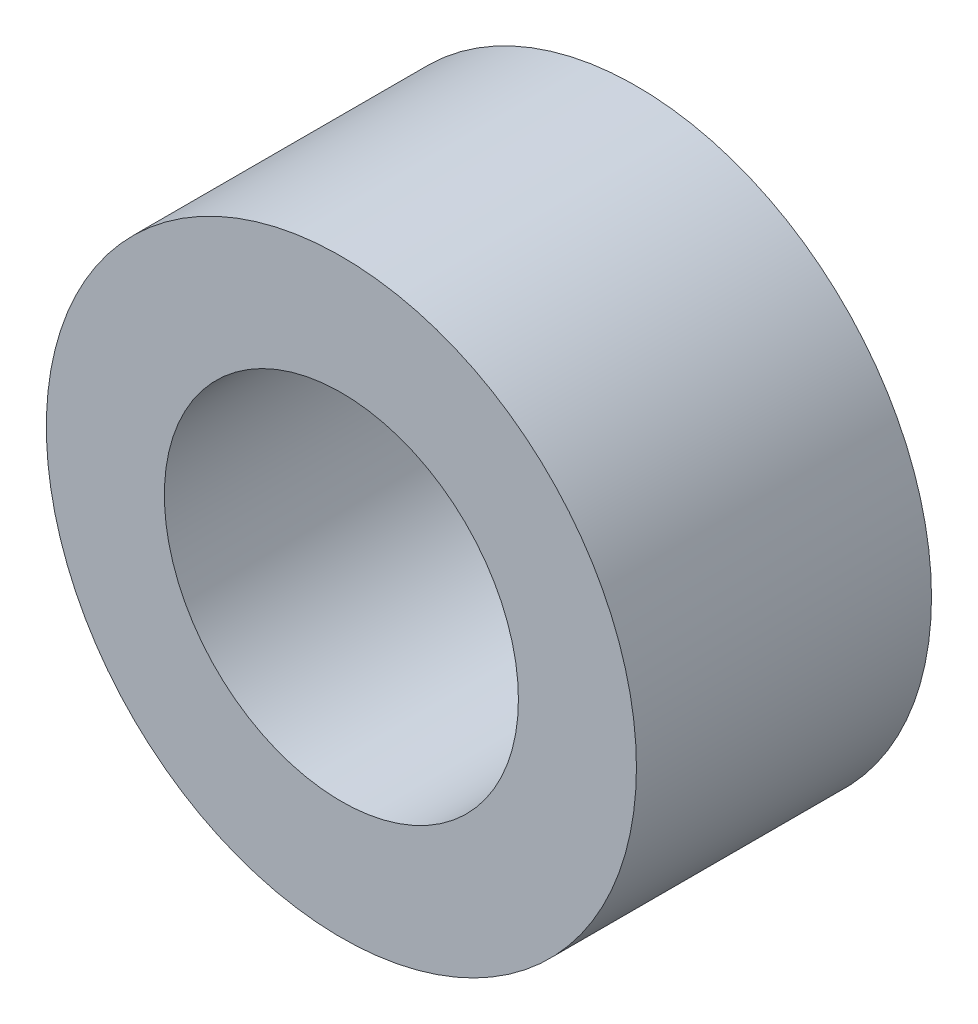
ISO-10303-21;
HEADER;
FILE_DESCRIPTION(('STEP AP214'),'2;1');
FILE_NAME('part.step','',(''),(''),'','','');
FILE_SCHEMA(('AUTOMOTIVE_DESIGN { 1 0 10303 214 1 1 1 1 }'));
ENDSEC;
DATA;
#1=APPLICATION_CONTEXT('core data for automotive mechanical design processes');
#2=APPLICATION_PROTOCOL_DEFINITION('international standard','automotive_design',2000,#1);
#3=PRODUCT_CONTEXT('',#1,'mechanical');
#4=PRODUCT('Part','Part','',(#3));
#5=PRODUCT_RELATED_PRODUCT_CATEGORY('part','',(#4));
#6=PRODUCT_DEFINITION_FORMATION('','',#4);
#7=PRODUCT_DEFINITION_CONTEXT('part definition',#1,'design');
#8=PRODUCT_DEFINITION('design','',#6,#7);
#9=PRODUCT_DEFINITION_SHAPE('','',#8);
#10=(LENGTH_UNIT() NAMED_UNIT(*) SI_UNIT(.MILLI.,.METRE.));
#11=(NAMED_UNIT(*) PLANE_ANGLE_UNIT() SI_UNIT($,.RADIAN.));
#12=(NAMED_UNIT(*) SI_UNIT($,.STERADIAN.) SOLID_ANGLE_UNIT());
#13=UNCERTAINTY_MEASURE_WITH_UNIT(LENGTH_MEASURE(1.E-05),#10,'distance_accuracy_value','');
#14=(GEOMETRIC_REPRESENTATION_CONTEXT(3) GLOBAL_UNCERTAINTY_ASSIGNED_CONTEXT((#13)) GLOBAL_UNIT_ASSIGNED_CONTEXT((#10,
#11,#12)) REPRESENTATION_CONTEXT('',''));
#15=CARTESIAN_POINT('',(0.,0.,0.));
#16=DIRECTION('',(0.,0.,1.));
#17=DIRECTION('',(1.,0.,0.));
#18=AXIS2_PLACEMENT_3D('',#15,#16,#17);
#19=CARTESIAN_POINT('',(0.,0.,10.));
#20=DIRECTION('',(0.,0.,1.));
#21=DIRECTION('',(1.,0.,0.));
#22=AXIS2_PLACEMENT_3D('',#19,#20,#21);
#23=PLANE('',#22);
#24=CARTESIAN_POINT('',(0.,0.,10.));
#25=DIRECTION('',(0.,0.,1.));
#26=DIRECTION('',(1.,0.,0.));
#27=AXIS2_PLACEMENT_3D('',#24,#25,#26);
#28=CIRCLE('',#27,10.);
#29=CARTESIAN_POINT('',(10.,0.,10.));
#30=VERTEX_POINT('',#29);
#31=EDGE_CURVE('E10',#30,#30,#28,.T.);
#32=ORIENTED_EDGE('',*,*,#31,.T.);
#33=EDGE_LOOP('',(#32));
#34=FACE_BOUND('',#33,.T.);
#35=CARTESIAN_POINT('',(0.,0.,10.));
#36=DIRECTION('',(0.,0.,1.));
#37=DIRECTION('',(1.,0.,0.));
#38=AXIS2_PLACEMENT_3D('',#35,#36,#37);
#39=CIRCLE('',#38,6.);
#40=CARTESIAN_POINT('',(6.,0.,10.));
#41=VERTEX_POINT('',#40);
#42=EDGE_CURVE('E50',#41,#41,#39,.T.);
#43=ORIENTED_EDGE('',*,*,#42,.F.);
#44=EDGE_LOOP('',(#43));
#45=FACE_BOUND('',#44,.T.);
#46=ADVANCED_FACE('F36',(#34,#45),#23,.T.);
#47=CARTESIAN_POINT('',(0.,0.,0.));
#48=DIRECTION('',(0.,0.,1.));
#49=DIRECTION('',(1.,0.,0.));
#50=AXIS2_PLACEMENT_3D('',#47,#48,#49);
#51=PLANE('',#50);
#52=CARTESIAN_POINT('',(0.,0.,0.));
#53=DIRECTION('',(0.,0.,1.));
#54=DIRECTION('',(1.,0.,0.));
#55=AXIS2_PLACEMENT_3D('',#52,#53,#54);
#56=CIRCLE('',#55,10.);
#57=CARTESIAN_POINT('',(10.,0.,0.));
#58=VERTEX_POINT('',#57);
#59=EDGE_CURVE('E40',#58,#58,#56,.T.);
#60=ORIENTED_EDGE('',*,*,#59,.F.);
#61=EDGE_LOOP('',(#60));
#62=FACE_BOUND('',#61,.T.);
#63=CARTESIAN_POINT('',(0.,0.,0.));
#64=DIRECTION('',(0.,0.,1.));
#65=DIRECTION('',(1.,0.,0.));
#66=AXIS2_PLACEMENT_3D('',#63,#64,#65);
#67=CIRCLE('',#66,6.);
#68=CARTESIAN_POINT('',(6.,0.,0.));
#69=VERTEX_POINT('',#68);
#70=EDGE_CURVE('E52',#69,#69,#67,.T.);
#71=ORIENTED_EDGE('',*,*,#70,.T.);
#72=EDGE_LOOP('',(#71));
#73=FACE_BOUND('',#72,.T.);
#74=ADVANCED_FACE('F65',(#62,#73),#51,.F.);
#75=CARTESIAN_POINT('',(0.,0.,10.));
#76=DIRECTION('',(0.,0.,-1.));
#77=DIRECTION('',(-1.,0.,0.));
#78=AXIS2_PLACEMENT_3D('',#75,#76,#77);
#79=CYLINDRICAL_SURFACE('',#78,10.);
#80=ORIENTED_EDGE('',*,*,#31,.F.);
#81=EDGE_LOOP('',(#80));
#82=FACE_BOUND('',#81,.T.);
#83=ORIENTED_EDGE('',*,*,#59,.T.);
#84=EDGE_LOOP('',(#83));
#85=FACE_BOUND('',#84,.T.);
#86=ADVANCED_FACE('F38',(#82,#85),#79,.T.);
#87=CARTESIAN_POINT('',(0.,0.,10.));
#88=DIRECTION('',(0.,0.,-1.));
#89=DIRECTION('',(-1.,0.,0.));
#90=AXIS2_PLACEMENT_3D('',#87,#88,#89);
#91=CYLINDRICAL_SURFACE('',#90,6.);
#92=ORIENTED_EDGE('',*,*,#42,.T.);
#93=EDGE_LOOP('',(#92));
#94=FACE_BOUND('',#93,.T.);
#95=ORIENTED_EDGE('',*,*,#70,.F.);
#96=EDGE_LOOP('',(#95));
#97=FACE_BOUND('',#96,.T.);
#98=ADVANCED_FACE('F61',(#94,#97),#91,.F.);
#99=CLOSED_SHELL('',(#46,#74,#86,#98));
#100=MANIFOLD_SOLID_BREP('B2',#99);
#101=ADVANCED_BREP_SHAPE_REPRESENTATION('',(#18,#100),#14);
#102=SHAPE_DEFINITION_REPRESENTATION(#9,#101);
ENDSEC;
END-ISO-10303-21;
